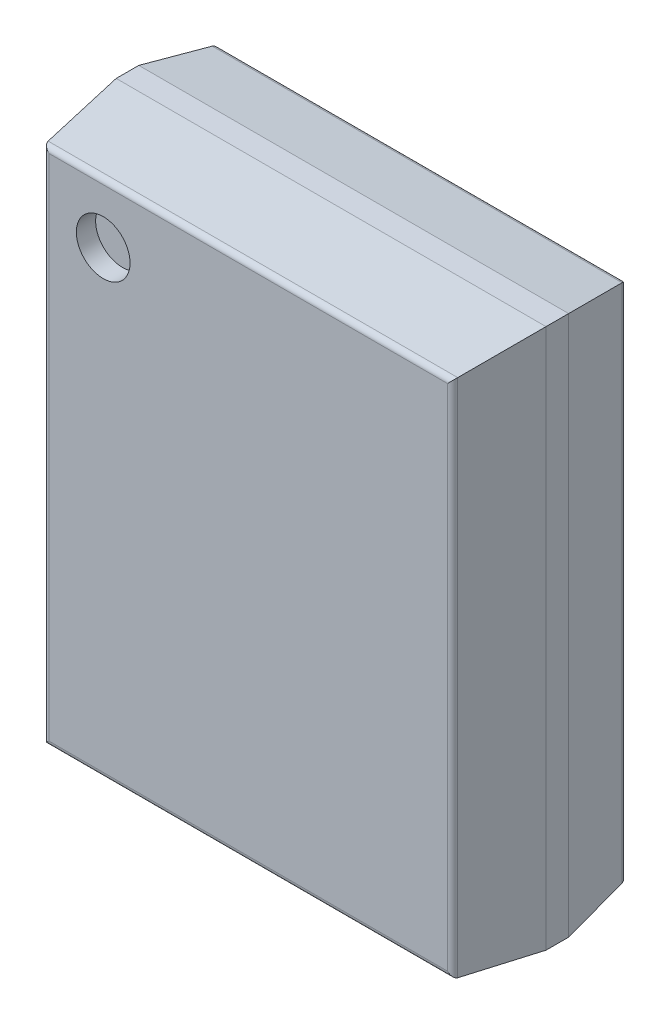
ISO-10303-21;
HEADER;
FILE_DESCRIPTION(('STEP AP214'),'2;1');
FILE_NAME('part.step','',(''),(''),'','','');
FILE_SCHEMA(('AUTOMOTIVE_DESIGN { 1 0 10303 214 1 1 1 1 }'));
ENDSEC;
DATA;
#1=APPLICATION_CONTEXT('core data for automotive mechanical design processes');
#2=APPLICATION_PROTOCOL_DEFINITION('international standard','automotive_design',2000,#1);
#3=PRODUCT_CONTEXT('',#1,'mechanical');
#4=PRODUCT('Part','Part','',(#3));
#5=PRODUCT_RELATED_PRODUCT_CATEGORY('part','',(#4));
#6=PRODUCT_DEFINITION_FORMATION('','',#4);
#7=PRODUCT_DEFINITION_CONTEXT('part definition',#1,'design');
#8=PRODUCT_DEFINITION('design','',#6,#7);
#9=PRODUCT_DEFINITION_SHAPE('','',#8);
#10=(LENGTH_UNIT() NAMED_UNIT(*) SI_UNIT(.MILLI.,.METRE.));
#11=(NAMED_UNIT(*) PLANE_ANGLE_UNIT() SI_UNIT($,.RADIAN.));
#12=(NAMED_UNIT(*) SI_UNIT($,.STERADIAN.) SOLID_ANGLE_UNIT());
#13=UNCERTAINTY_MEASURE_WITH_UNIT(LENGTH_MEASURE(1.E-05),#10,'distance_accuracy_value','');
#14=(GEOMETRIC_REPRESENTATION_CONTEXT(3) GLOBAL_UNCERTAINTY_ASSIGNED_CONTEXT((#13)) GLOBAL_UNIT_ASSIGNED_CONTEXT((#10,
#11,#12)) REPRESENTATION_CONTEXT('',''));
#15=CARTESIAN_POINT('',(0.,0.,0.));
#16=DIRECTION('',(0.,0.,1.));
#17=DIRECTION('',(1.,0.,0.));
#18=AXIS2_PLACEMENT_3D('',#15,#16,#17);
#19=CARTESIAN_POINT('',(-1.90125,-2.45,0.483623210137));
#20=DIRECTION('',(-0.987753092714965,0.,-0.156025087187994));
#21=DIRECTION('',(0.,1.,0.));
#22=AXIS2_PLACEMENT_3D('',#19,#20,#21);
#23=PLANE('',#22);
#24=DIRECTION('',(0.154159948465986,0.154159948465986,-0.975945398358909));
#25=VECTOR('',#24,1.);
#26=CARTESIAN_POINT('',(-1.902408557873,-2.402408557873,0.490957730138));
#27=LINE('',#26,#25);
#28=CARTESIAN_POINT('',(-1.95,-2.45,0.792246420274));
#29=VERTEX_POINT('',#28);
#30=CARTESIAN_POINT('',(-1.859165697143,-2.359165697143,0.217198745641));
#31=VERTEX_POINT('',#30);
#32=EDGE_CURVE('E11',#29,#31,#27,.T.);
#33=ORIENTED_EDGE('',*,*,#32,.F.);
#34=DIRECTION('',(0.,1.,0.));
#35=VECTOR('',#34,1.);
#36=CARTESIAN_POINT('',(-1.95,-2.45,0.792246420274));
#37=LINE('',#36,#35);
#38=CARTESIAN_POINT('',(-1.95,2.45,0.792246420274));
#39=VERTEX_POINT('',#38);
#40=EDGE_CURVE('E24',#29,#39,#37,.T.);
#41=ORIENTED_EDGE('',*,*,#40,.T.);
#42=DIRECTION('',(0.154159948465986,-0.154159948465986,-0.975945398358909));
#43=VECTOR('',#42,1.);
#44=CARTESIAN_POINT('',(-1.844183598082,2.344183598082,0.122351083963));
#45=LINE('',#44,#43);
#46=CARTESIAN_POINT('',(-1.859165697143,2.359165697143,0.217198745641));
#47=VERTEX_POINT('',#46);
#48=EDGE_CURVE('E221',#39,#47,#45,.T.);
#49=ORIENTED_EDGE('',*,*,#48,.T.);
#50=DIRECTION('',(0.,1.,0.));
#51=VECTOR('',#50,1.);
#52=CARTESIAN_POINT('',(-1.859165697143,-2.3525,0.217198745641));
#53=LINE('',#52,#51);
#54=EDGE_CURVE('E218',#31,#47,#53,.T.);
#55=ORIENTED_EDGE('',*,*,#54,.F.);
#56=EDGE_LOOP('',(#33,#41,#49,#55));
#57=FACE_BOUND('',#56,.T.);
#58=ADVANCED_FACE('F17',(#57),#23,.T.);
#59=CARTESIAN_POINT('',(-1.95,-2.40125,0.483623210137));
#60=DIRECTION('',(0.,-0.987753092714965,-0.156025087187994));
#61=DIRECTION('',(-1.,0.,0.));
#62=AXIS2_PLACEMENT_3D('',#59,#60,#61);
#63=PLANE('',#62);
#64=DIRECTION('',(1.,0.,0.));
#65=VECTOR('',#64,1.);
#66=CARTESIAN_POINT('',(-1.8525,-2.359165697143,0.217198745641));
#67=LINE('',#66,#65);
#68=CARTESIAN_POINT('',(1.859165697143,-2.359165697143,0.217198745641));
#69=VERTEX_POINT('',#68);
#70=EDGE_CURVE('E216',#31,#69,#67,.T.);
#71=ORIENTED_EDGE('',*,*,#70,.T.);
#72=DIRECTION('',(-0.154159948465986,0.154159948465986,-0.975945398358909));
#73=VECTOR('',#72,1.);
#74=CARTESIAN_POINT('',(1.856066242937,-2.356066242937,0.197576930121));
#75=LINE('',#74,#73);
#76=CARTESIAN_POINT('',(1.95,-2.45,0.792246420274));
#77=VERTEX_POINT('',#76);
#78=EDGE_CURVE('E214',#77,#69,#75,.T.);
#79=ORIENTED_EDGE('',*,*,#78,.F.);
#80=DIRECTION('',(1.,0.,0.));
#81=VECTOR('',#80,1.);
#82=CARTESIAN_POINT('',(-1.95,-2.45,0.792246420274));
#83=LINE('',#82,#81);
#84=EDGE_CURVE('E212',#29,#77,#83,.T.);
#85=ORIENTED_EDGE('',*,*,#84,.F.);
#86=ORIENTED_EDGE('',*,*,#32,.T.);
#87=EDGE_LOOP('',(#71,#79,#85,#86));
#88=FACE_BOUND('',#87,.T.);
#89=ADVANCED_FACE('F277',(#88),#63,.T.);
#90=CARTESIAN_POINT('',(-1.809778042507,-2.3525,0.225));
#91=DIRECTION('',(0.,1.,0.));
#92=DIRECTION('',(-0.987753092714965,0.,-0.156025087187994));
#93=AXIS2_PLACEMENT_3D('',#90,#91,#92);
#94=CYLINDRICAL_SURFACE('',#93,0.05);
#95=ORIENTED_EDGE('',*,*,#54,.T.);
#96=CARTESIAN_POINT('',(-1.809778042507,2.309778042507,0.225));
#97=DIRECTION('',(-0.707106781186548,-0.707106781186548,0.));
#98=DIRECTION('',(-0.707106781186548,0.707106781186548,0.));
#99=AXIS2_PLACEMENT_3D('',#96,#97,#98);
#100=ELLIPSE('',#99,0.07071067811865,0.05);
#101=CARTESIAN_POINT('',(-1.809778042507,2.309778042507,0.175));
#102=VERTEX_POINT('',#101);
#103=EDGE_CURVE('E210',#47,#102,#100,.T.);
#104=ORIENTED_EDGE('',*,*,#103,.T.);
#105=DIRECTION('',(0.,1.,0.));
#106=VECTOR('',#105,1.);
#107=CARTESIAN_POINT('',(-1.809778042507,-2.3525,0.175));
#108=LINE('',#107,#106);
#109=CARTESIAN_POINT('',(-1.809778042507,-2.309778042507,0.175));
#110=VERTEX_POINT('',#109);
#111=EDGE_CURVE('E207',#110,#102,#108,.T.);
#112=ORIENTED_EDGE('',*,*,#111,.F.);
#113=CARTESIAN_POINT('',(-1.809778042507,-2.309778042507,0.225));
#114=DIRECTION('',(0.707106781186548,-0.707106781186548,0.));
#115=DIRECTION('',(0.707106781186548,0.707106781186548,0.));
#116=AXIS2_PLACEMENT_3D('',#113,#114,#115);
#117=ELLIPSE('',#116,0.07071067811865,0.05);
#118=EDGE_CURVE('E204',#31,#110,#117,.T.);
#119=ORIENTED_EDGE('',*,*,#118,.F.);
#120=EDGE_LOOP('',(#95,#104,#112,#119));
#121=FACE_BOUND('',#120,.T.);
#122=ADVANCED_FACE('F253',(#121),#94,.T.);
#123=CARTESIAN_POINT('',(-1.95,-2.45,0.175));
#124=DIRECTION('',(1.,0.,0.));
#125=DIRECTION('',(0.,0.,1.));
#126=AXIS2_PLACEMENT_3D('',#123,#124,#125);
#127=PLANE('',#126);
#128=DIRECTION('',(0.,1.,0.));
#129=VECTOR('',#128,1.);
#130=CARTESIAN_POINT('',(-1.95,-2.45,0.997246420274));
#131=LINE('',#130,#129);
#132=CARTESIAN_POINT('',(-1.95,-2.45,0.997246420274));
#133=VERTEX_POINT('',#132);
#134=CARTESIAN_POINT('',(-1.95,2.45,0.997246420274));
#135=VERTEX_POINT('',#134);
#136=EDGE_CURVE('E201',#133,#135,#131,.T.);
#137=ORIENTED_EDGE('',*,*,#136,.T.);
#138=DIRECTION('',(0.,0.,1.));
#139=VECTOR('',#138,1.);
#140=CARTESIAN_POINT('',(-1.95,2.45,0.175));
#141=LINE('',#140,#139);
#142=EDGE_CURVE('E199',#39,#135,#141,.T.);
#143=ORIENTED_EDGE('',*,*,#142,.F.);
#144=ORIENTED_EDGE('',*,*,#40,.F.);
#145=DIRECTION('',(0.,0.,1.));
#146=VECTOR('',#145,1.);
#147=CARTESIAN_POINT('',(-1.95,-2.45,0.175));
#148=LINE('',#147,#146);
#149=EDGE_CURVE('E197',#29,#133,#148,.T.);
#150=ORIENTED_EDGE('',*,*,#149,.T.);
#151=EDGE_LOOP('',(#137,#143,#144,#150));
#152=FACE_BOUND('',#151,.T.);
#153=ADVANCED_FACE('F230',(#152),#127,.F.);
#154=CARTESIAN_POINT('',(-1.95,2.40125,0.483623210137));
#155=DIRECTION('',(0.,-0.987753092714965,0.156025087187994));
#156=DIRECTION('',(-1.,0.,0.));
#157=AXIS2_PLACEMENT_3D('',#154,#155,#156);
#158=PLANE('',#157);
#159=ORIENTED_EDGE('',*,*,#48,.F.);
#160=DIRECTION('',(1.,0.,0.));
#161=VECTOR('',#160,1.);
#162=CARTESIAN_POINT('',(-1.95,2.45,0.792246420274));
#163=LINE('',#162,#161);
#164=CARTESIAN_POINT('',(1.95,2.45,0.792246420274));
#165=VERTEX_POINT('',#164);
#166=EDGE_CURVE('E195',#39,#165,#163,.T.);
#167=ORIENTED_EDGE('',*,*,#166,.T.);
#168=DIRECTION('',(-0.154159948465986,-0.154159948465986,-0.975945398358909));
#169=VECTOR('',#168,1.);
#170=CARTESIAN_POINT('',(1.797841283145,2.297841283145,-0.171029716054));
#171=LINE('',#170,#169);
#172=CARTESIAN_POINT('',(1.859165697143,2.359165697143,0.217198745641));
#173=VERTEX_POINT('',#172);
#174=EDGE_CURVE('E193',#165,#173,#171,.T.);
#175=ORIENTED_EDGE('',*,*,#174,.T.);
#176=DIRECTION('',(1.,0.,0.));
#177=VECTOR('',#176,1.);
#178=CARTESIAN_POINT('',(-1.8525,2.359165697143,0.217198745641));
#179=LINE('',#178,#177);
#180=EDGE_CURVE('E190',#47,#173,#179,.T.);
#181=ORIENTED_EDGE('',*,*,#180,.F.);
#182=EDGE_LOOP('',(#159,#167,#175,#181));
#183=FACE_BOUND('',#182,.T.);
#184=ADVANCED_FACE('F227',(#183),#158,.F.);
#185=CARTESIAN_POINT('',(-1.8525,-2.309778042507,0.225));
#186=DIRECTION('',(1.,0.,0.));
#187=DIRECTION('',(0.,-0.987753092714965,-0.156025087187994));
#188=AXIS2_PLACEMENT_3D('',#185,#186,#187);
#189=CYLINDRICAL_SURFACE('',#188,0.05);
#190=ORIENTED_EDGE('',*,*,#118,.T.);
#191=DIRECTION('',(1.,0.,0.));
#192=VECTOR('',#191,1.);
#193=CARTESIAN_POINT('',(-1.8525,-2.309778042507,0.175));
#194=LINE('',#193,#192);
#195=CARTESIAN_POINT('',(1.809778042507,-2.309778042507,0.175));
#196=VERTEX_POINT('',#195);
#197=EDGE_CURVE('E188',#110,#196,#194,.T.);
#198=ORIENTED_EDGE('',*,*,#197,.T.);
#199=CARTESIAN_POINT('',(1.809778042507,-2.309778042507,0.225));
#200=DIRECTION('',(0.707106781186548,0.707106781186548,0.));
#201=DIRECTION('',(0.707106781186548,-0.707106781186548,0.));
#202=AXIS2_PLACEMENT_3D('',#199,#200,#201);
#203=ELLIPSE('',#202,0.07071067811865,0.05);
#204=EDGE_CURVE('E185',#69,#196,#203,.T.);
#205=ORIENTED_EDGE('',*,*,#204,.F.);
#206=ORIENTED_EDGE('',*,*,#70,.F.);
#207=EDGE_LOOP('',(#190,#198,#205,#206));
#208=FACE_BOUND('',#207,.T.);
#209=ADVANCED_FACE('F261',(#208),#189,.T.);
#210=CARTESIAN_POINT('',(-1.95,-2.45,0.175));
#211=DIRECTION('',(0.,1.,0.));
#212=DIRECTION('',(0.,0.,1.));
#213=AXIS2_PLACEMENT_3D('',#210,#211,#212);
#214=PLANE('',#213);
#215=DIRECTION('',(1.,0.,0.));
#216=VECTOR('',#215,1.);
#217=CARTESIAN_POINT('',(-1.95,-2.45,0.997246420274));
#218=LINE('',#217,#216);
#219=CARTESIAN_POINT('',(1.95,-2.45,0.997246420274));
#220=VERTEX_POINT('',#219);
#221=EDGE_CURVE('E182',#133,#220,#218,.T.);
#222=ORIENTED_EDGE('',*,*,#221,.F.);
#223=ORIENTED_EDGE('',*,*,#149,.F.);
#224=ORIENTED_EDGE('',*,*,#84,.T.);
#225=DIRECTION('',(0.,0.,1.));
#226=VECTOR('',#225,1.);
#227=CARTESIAN_POINT('',(1.95,-2.45,0.175));
#228=LINE('',#227,#226);
#229=EDGE_CURVE('E180',#77,#220,#228,.T.);
#230=ORIENTED_EDGE('',*,*,#229,.T.);
#231=EDGE_LOOP('',(#222,#223,#224,#230));
#232=FACE_BOUND('',#231,.T.);
#233=ADVANCED_FACE('F292',(#232),#214,.F.);
#234=CARTESIAN_POINT('',(1.90125,-2.45,0.483623210137));
#235=DIRECTION('',(-0.987753092714965,0.,0.156025087187994));
#236=DIRECTION('',(0.,1.,0.));
#237=AXIS2_PLACEMENT_3D('',#234,#235,#236);
#238=PLANE('',#237);
#239=DIRECTION('',(0.,1.,0.));
#240=VECTOR('',#239,1.);
#241=CARTESIAN_POINT('',(1.859165697143,-2.3525,0.217198745641));
#242=LINE('',#241,#240);
#243=EDGE_CURVE('E177',#69,#173,#242,.T.);
#244=ORIENTED_EDGE('',*,*,#243,.T.);
#245=ORIENTED_EDGE('',*,*,#174,.F.);
#246=DIRECTION('',(0.,1.,0.));
#247=VECTOR('',#246,1.);
#248=CARTESIAN_POINT('',(1.95,-2.45,0.792246420274));
#249=LINE('',#248,#247);
#250=EDGE_CURVE('E174',#77,#165,#249,.T.);
#251=ORIENTED_EDGE('',*,*,#250,.F.);
#252=ORIENTED_EDGE('',*,*,#78,.T.);
#253=EDGE_LOOP('',(#244,#245,#251,#252));
#254=FACE_BOUND('',#253,.T.);
#255=ADVANCED_FACE('F244',(#254),#238,.F.);
#256=CARTESIAN_POINT('',(-1.95,-2.45,0.175));
#257=DIRECTION('',(0.,0.,1.));
#258=DIRECTION('',(1.,0.,0.));
#259=AXIS2_PLACEMENT_3D('',#256,#257,#258);
#260=PLANE('',#259);
#261=DIRECTION('',(1.,0.,0.));
#262=VECTOR('',#261,1.);
#263=CARTESIAN_POINT('',(-1.8525,2.309778042507,0.175));
#264=LINE('',#263,#262);
#265=CARTESIAN_POINT('',(1.809778042507,2.309778042507,0.175));
#266=VERTEX_POINT('',#265);
#267=EDGE_CURVE('E171',#102,#266,#264,.T.);
#268=ORIENTED_EDGE('',*,*,#267,.T.);
#269=DIRECTION('',(0.,1.,0.));
#270=VECTOR('',#269,1.);
#271=CARTESIAN_POINT('',(1.809778042507,-2.3525,0.175));
#272=LINE('',#271,#270);
#273=EDGE_CURVE('E169',#196,#266,#272,.T.);
#274=ORIENTED_EDGE('',*,*,#273,.F.);
#275=ORIENTED_EDGE('',*,*,#197,.F.);
#276=ORIENTED_EDGE('',*,*,#111,.T.);
#277=EDGE_LOOP('',(#268,#274,#275,#276));
#278=FACE_BOUND('',#277,.T.);
#279=ADVANCED_FACE('F257',(#278),#260,.F.);
#280=CARTESIAN_POINT('',(-1.8525,2.309778042507,0.225));
#281=DIRECTION('',(1.,0.,0.));
#282=DIRECTION('',(0.,0.,-1.));
#283=AXIS2_PLACEMENT_3D('',#280,#281,#282);
#284=CYLINDRICAL_SURFACE('',#283,0.05);
#285=ORIENTED_EDGE('',*,*,#103,.F.);
#286=ORIENTED_EDGE('',*,*,#180,.T.);
#287=CARTESIAN_POINT('',(1.809778042507,2.309778042507,0.225));
#288=DIRECTION('',(0.707106781186548,-0.707106781186548,0.));
#289=DIRECTION('',(0.707106781186548,0.707106781186548,0.));
#290=AXIS2_PLACEMENT_3D('',#287,#288,#289);
#291=ELLIPSE('',#290,0.07071067811865,0.05);
#292=EDGE_CURVE('E166',#266,#173,#291,.T.);
#293=ORIENTED_EDGE('',*,*,#292,.F.);
#294=ORIENTED_EDGE('',*,*,#267,.F.);
#295=EDGE_LOOP('',(#285,#286,#293,#294));
#296=FACE_BOUND('',#295,.T.);
#297=ADVANCED_FACE('F250',(#296),#284,.T.);
#298=CARTESIAN_POINT('',(-1.90125,-2.45,1.373623210137));
#299=DIRECTION('',(0.991715798237691,0.,-0.12845145201896));
#300=DIRECTION('',(0.,1.,0.));
#301=AXIS2_PLACEMENT_3D('',#298,#299,#300);
#302=PLANE('',#301);
#303=DIRECTION('',(0.,1.,0.));
#304=VECTOR('',#303,1.);
#305=CARTESIAN_POINT('',(-1.858144342698,-2.3525,1.706422572601));
#306=LINE('',#305,#304);
#307=CARTESIAN_POINT('',(-1.858144342698,-2.358144342698,1.706422572601));
#308=VERTEX_POINT('',#307);
#309=CARTESIAN_POINT('',(-1.858144342698,2.358144342698,1.706422572601));
#310=VERTEX_POINT('',#309);
#311=EDGE_CURVE('E163',#308,#310,#306,.T.);
#312=ORIENTED_EDGE('',*,*,#311,.T.);
#313=DIRECTION('',(0.12740467794397,-0.12740467794397,0.983634127140771));
#314=VECTOR('',#313,1.);
#315=CARTESIAN_POINT('',(-1.862273025351,2.362273025351,1.674546873663));
#316=LINE('',#315,#314);
#317=EDGE_CURVE('E161',#135,#310,#316,.T.);
#318=ORIENTED_EDGE('',*,*,#317,.F.);
#319=ORIENTED_EDGE('',*,*,#136,.F.);
#320=DIRECTION('',(0.12740467794397,0.12740467794397,0.983634127140771));
#321=VECTOR('',#320,1.);
#322=CARTESIAN_POINT('',(-1.902041307658,-2.402041307658,1.367513880164));
#323=LINE('',#322,#321);
#324=EDGE_CURVE('E159',#133,#308,#323,.T.);
#325=ORIENTED_EDGE('',*,*,#324,.T.);
#326=EDGE_LOOP('',(#312,#318,#319,#325));
#327=FACE_BOUND('',#326,.T.);
#328=ADVANCED_FACE('F274',(#327),#302,.F.);
#329=CARTESIAN_POINT('',(-1.95,2.45,0.175));
#330=DIRECTION('',(0.,1.,0.));
#331=DIRECTION('',(0.,0.,1.));
#332=AXIS2_PLACEMENT_3D('',#329,#330,#331);
#333=PLANE('',#332);
#334=DIRECTION('',(0.,0.,1.));
#335=VECTOR('',#334,1.);
#336=CARTESIAN_POINT('',(1.95,2.45,0.175));
#337=LINE('',#336,#335);
#338=CARTESIAN_POINT('',(1.95,2.45,0.997246420274));
#339=VERTEX_POINT('',#338);
#340=EDGE_CURVE('E157',#165,#339,#337,.T.);
#341=ORIENTED_EDGE('',*,*,#340,.F.);
#342=ORIENTED_EDGE('',*,*,#166,.F.);
#343=ORIENTED_EDGE('',*,*,#142,.T.);
#344=DIRECTION('',(1.,0.,0.));
#345=VECTOR('',#344,1.);
#346=CARTESIAN_POINT('',(-1.95,2.45,0.997246420274));
#347=LINE('',#346,#345);
#348=EDGE_CURVE('E154',#135,#339,#347,.T.);
#349=ORIENTED_EDGE('',*,*,#348,.T.);
#350=EDGE_LOOP('',(#341,#342,#343,#349));
#351=FACE_BOUND('',#350,.T.);
#352=ADVANCED_FACE('F235',(#351),#333,.T.);
#353=CARTESIAN_POINT('',(1.809778042507,-2.3525,0.225));
#354=DIRECTION('',(0.,1.,0.));
#355=DIRECTION('',(0.,0.,-1.));
#356=AXIS2_PLACEMENT_3D('',#353,#354,#355);
#357=CYLINDRICAL_SURFACE('',#356,0.05);
#358=ORIENTED_EDGE('',*,*,#273,.T.);
#359=ORIENTED_EDGE('',*,*,#292,.T.);
#360=ORIENTED_EDGE('',*,*,#243,.F.);
#361=ORIENTED_EDGE('',*,*,#204,.T.);
#362=EDGE_LOOP('',(#358,#359,#360,#361));
#363=FACE_BOUND('',#362,.T.);
#364=ADVANCED_FACE('F264',(#363),#357,.T.);
#365=CARTESIAN_POINT('',(1.95,-2.45,0.175));
#366=DIRECTION('',(1.,0.,0.));
#367=DIRECTION('',(0.,0.,1.));
#368=AXIS2_PLACEMENT_3D('',#365,#366,#367);
#369=PLANE('',#368);
#370=ORIENTED_EDGE('',*,*,#229,.F.);
#371=ORIENTED_EDGE('',*,*,#250,.T.);
#372=ORIENTED_EDGE('',*,*,#340,.T.);
#373=DIRECTION('',(0.,1.,0.));
#374=VECTOR('',#373,1.);
#375=CARTESIAN_POINT('',(1.95,-2.45,0.997246420274));
#376=LINE('',#375,#374);
#377=EDGE_CURVE('E151',#220,#339,#376,.T.);
#378=ORIENTED_EDGE('',*,*,#377,.F.);
#379=EDGE_LOOP('',(#370,#371,#372,#378));
#380=FACE_BOUND('',#379,.T.);
#381=ADVANCED_FACE('F240',(#380),#369,.T.);
#382=CARTESIAN_POINT('',(-1.95,-2.40125,1.373623210137));
#383=DIRECTION('',(0.,0.991715798237691,-0.12845145201896));
#384=DIRECTION('',(-1.,0.,0.));
#385=AXIS2_PLACEMENT_3D('',#382,#383,#384);
#386=PLANE('',#385);
#387=ORIENTED_EDGE('',*,*,#324,.F.);
#388=ORIENTED_EDGE('',*,*,#221,.T.);
#389=DIRECTION('',(-0.12740467794397,0.12740467794397,0.983634127140771));
#390=VECTOR('',#389,1.);
#391=CARTESIAN_POINT('',(1.870389001332,-2.370389001332,1.611887079072));
#392=LINE('',#391,#390);
#393=CARTESIAN_POINT('',(1.858144342698,-2.358144342698,1.706422572601));
#394=VERTEX_POINT('',#393);
#395=EDGE_CURVE('E149',#220,#394,#392,.T.);
#396=ORIENTED_EDGE('',*,*,#395,.T.);
#397=DIRECTION('',(1.,0.,0.));
#398=VECTOR('',#397,1.);
#399=CARTESIAN_POINT('',(-1.8525,-2.358144342698,1.706422572601));
#400=LINE('',#399,#398);
#401=EDGE_CURVE('E146',#308,#394,#400,.T.);
#402=ORIENTED_EDGE('',*,*,#401,.F.);
#403=EDGE_LOOP('',(#387,#388,#396,#402));
#404=FACE_BOUND('',#403,.T.);
#405=ADVANCED_FACE('F272',(#404),#386,.F.);
#406=CARTESIAN_POINT('',(-1.808558552786,-2.3525,1.7));
#407=DIRECTION('',(0.,1.,0.));
#408=DIRECTION('',(-0.991715798237691,0.,0.12845145201896));
#409=AXIS2_PLACEMENT_3D('',#406,#407,#408);
#410=CYLINDRICAL_SURFACE('',#409,0.05);
#411=CARTESIAN_POINT('',(-1.808558552786,-2.308558552786,1.7));
#412=DIRECTION('',(-0.707106781186548,0.707106781186548,0.));
#413=DIRECTION('',(0.707106781186548,0.707106781186548,0.));
#414=AXIS2_PLACEMENT_3D('',#411,#412,#413);
#415=ELLIPSE('',#414,0.07071067811865,0.05);
#416=CARTESIAN_POINT('',(-1.808558552786,-2.308558552786,1.75));
#417=VERTEX_POINT('',#416);
#418=EDGE_CURVE('E144',#308,#417,#415,.T.);
#419=ORIENTED_EDGE('',*,*,#418,.T.);
#420=DIRECTION('',(0.,1.,0.));
#421=VECTOR('',#420,1.);
#422=CARTESIAN_POINT('',(-1.808558552786,-2.3525,1.75));
#423=LINE('',#422,#421);
#424=CARTESIAN_POINT('',(-1.808558552786,2.308558552786,1.75));
#425=VERTEX_POINT('',#424);
#426=EDGE_CURVE('E142',#417,#425,#423,.T.);
#427=ORIENTED_EDGE('',*,*,#426,.T.);
#428=CARTESIAN_POINT('',(-1.808558552786,2.308558552786,1.7));
#429=DIRECTION('',(0.707106781186548,0.707106781186548,0.));
#430=DIRECTION('',(-0.707106781186548,0.707106781186548,0.));
#431=AXIS2_PLACEMENT_3D('',#428,#429,#430);
#432=ELLIPSE('',#431,0.07071067811865,0.05);
#433=EDGE_CURVE('E139',#310,#425,#432,.T.);
#434=ORIENTED_EDGE('',*,*,#433,.F.);
#435=ORIENTED_EDGE('',*,*,#311,.F.);
#436=EDGE_LOOP('',(#419,#427,#434,#435));
#437=FACE_BOUND('',#436,.T.);
#438=ADVANCED_FACE('F312',(#437),#410,.T.);
#439=CARTESIAN_POINT('',(-1.95,2.40125,1.373623210137));
#440=DIRECTION('',(0.,0.991715798237691,0.12845145201896));
#441=DIRECTION('',(-1.,0.,0.));
#442=AXIS2_PLACEMENT_3D('',#439,#440,#441);
#443=PLANE('',#442);
#444=DIRECTION('',(1.,0.,0.));
#445=VECTOR('',#444,1.);
#446=CARTESIAN_POINT('',(-1.8525,2.358144342698,1.706422572601));
#447=LINE('',#446,#445);
#448=CARTESIAN_POINT('',(1.858144342698,2.358144342698,1.706422572601));
#449=VERTEX_POINT('',#448);
#450=EDGE_CURVE('E136',#310,#449,#447,.T.);
#451=ORIENTED_EDGE('',*,*,#450,.T.);
#452=DIRECTION('',(-0.12740467794397,-0.12740467794397,0.983634127140771));
#453=VECTOR('',#452,1.);
#454=CARTESIAN_POINT('',(1.830620719025,2.330620719025,1.91892007257));
#455=LINE('',#454,#453);
#456=EDGE_CURVE('E134',#339,#449,#455,.T.);
#457=ORIENTED_EDGE('',*,*,#456,.F.);
#458=ORIENTED_EDGE('',*,*,#348,.F.);
#459=ORIENTED_EDGE('',*,*,#317,.T.);
#460=EDGE_LOOP('',(#451,#457,#458,#459));
#461=FACE_BOUND('',#460,.T.);
#462=ADVANCED_FACE('F320',(#461),#443,.T.);
#463=CARTESIAN_POINT('',(1.90125,-2.45,1.373623210137));
#464=DIRECTION('',(0.991715798237691,0.,0.12845145201896));
#465=DIRECTION('',(0.,1.,0.));
#466=AXIS2_PLACEMENT_3D('',#463,#464,#465);
#467=PLANE('',#466);
#468=ORIENTED_EDGE('',*,*,#395,.F.);
#469=ORIENTED_EDGE('',*,*,#377,.T.);
#470=ORIENTED_EDGE('',*,*,#456,.T.);
#471=DIRECTION('',(0.,1.,0.));
#472=VECTOR('',#471,1.);
#473=CARTESIAN_POINT('',(1.858144342698,-2.3525,1.706422572601));
#474=LINE('',#473,#472);
#475=EDGE_CURVE('E131',#394,#449,#474,.T.);
#476=ORIENTED_EDGE('',*,*,#475,.F.);
#477=EDGE_LOOP('',(#468,#469,#470,#476));
#478=FACE_BOUND('',#477,.T.);
#479=ADVANCED_FACE('F327',(#478),#467,.T.);
#480=CARTESIAN_POINT('',(-1.8525,-2.308558552786,1.7));
#481=DIRECTION('',(1.,0.,0.));
#482=DIRECTION('',(0.,-0.991715798237691,0.12845145201896));
#483=AXIS2_PLACEMENT_3D('',#480,#481,#482);
#484=CYLINDRICAL_SURFACE('',#483,0.05);
#485=ORIENTED_EDGE('',*,*,#401,.T.);
#486=CARTESIAN_POINT('',(1.808558552786,-2.308558552786,1.7));
#487=DIRECTION('',(-0.707106781186548,-0.707106781186548,0.));
#488=DIRECTION('',(0.707106781186548,-0.707106781186548,0.));
#489=AXIS2_PLACEMENT_3D('',#486,#487,#488);
#490=ELLIPSE('',#489,0.07071067811865,0.05);
#491=CARTESIAN_POINT('',(1.808558552786,-2.308558552786,1.75));
#492=VERTEX_POINT('',#491);
#493=EDGE_CURVE('E129',#394,#492,#490,.T.);
#494=ORIENTED_EDGE('',*,*,#493,.T.);
#495=DIRECTION('',(1.,0.,0.));
#496=VECTOR('',#495,1.);
#497=CARTESIAN_POINT('',(-1.8525,-2.308558552786,1.75));
#498=LINE('',#497,#496);
#499=EDGE_CURVE('E126',#417,#492,#498,.T.);
#500=ORIENTED_EDGE('',*,*,#499,.F.);
#501=ORIENTED_EDGE('',*,*,#418,.F.);
#502=EDGE_LOOP('',(#485,#494,#500,#501));
#503=FACE_BOUND('',#502,.T.);
#504=ADVANCED_FACE('F332',(#503),#484,.T.);
#505=CARTESIAN_POINT('',(-1.95,-2.45,1.75));
#506=DIRECTION('',(0.,0.,1.));
#507=DIRECTION('',(1.,0.,0.));
#508=AXIS2_PLACEMENT_3D('',#505,#506,#507);
#509=PLANE('',#508);
#510=ORIENTED_EDGE('',*,*,#426,.F.);
#511=ORIENTED_EDGE('',*,*,#499,.T.);
#512=DIRECTION('',(0.,1.,0.));
#513=VECTOR('',#512,1.);
#514=CARTESIAN_POINT('',(1.808558552786,-2.3525,1.75));
#515=LINE('',#514,#513);
#516=CARTESIAN_POINT('',(1.808558552786,2.308558552786,1.75));
#517=VERTEX_POINT('',#516);
#518=EDGE_CURVE('E124',#492,#517,#515,.T.);
#519=ORIENTED_EDGE('',*,*,#518,.T.);
#520=DIRECTION('',(1.,0.,0.));
#521=VECTOR('',#520,1.);
#522=CARTESIAN_POINT('',(-1.8525,2.308558552786,1.75));
#523=LINE('',#522,#521);
#524=EDGE_CURVE('E121',#425,#517,#523,.T.);
#525=ORIENTED_EDGE('',*,*,#524,.F.);
#526=EDGE_LOOP('',(#510,#511,#519,#525));
#527=FACE_BOUND('',#526,.T.);
#528=CARTESIAN_POINT('',(-1.315,1.815,1.75));
#529=DIRECTION('',(0.,0.,1.));
#530=DIRECTION('',(1.,0.,0.));
#531=AXIS2_PLACEMENT_3D('',#528,#529,#530);
#532=CIRCLE('',#531,0.24375);
#533=CARTESIAN_POINT('',(-1.07125,1.815,1.75));
#534=VERTEX_POINT('',#533);
#535=EDGE_CURVE('E119',#534,#534,#532,.T.);
#536=ORIENTED_EDGE('',*,*,#535,.F.);
#537=EDGE_LOOP('',(#536));
#538=FACE_BOUND('',#537,.T.);
#539=ADVANCED_FACE('F335',(#527,#538),#509,.T.);
#540=CARTESIAN_POINT('',(-1.8525,2.308558552786,1.7));
#541=DIRECTION('',(1.,0.,0.));
#542=DIRECTION('',(0.,0.,1.));
#543=AXIS2_PLACEMENT_3D('',#540,#541,#542);
#544=CYLINDRICAL_SURFACE('',#543,0.05);
#545=ORIENTED_EDGE('',*,*,#524,.T.);
#546=CARTESIAN_POINT('',(1.808558552786,2.308558552786,1.7));
#547=DIRECTION('',(-0.707106781186548,0.707106781186548,0.));
#548=DIRECTION('',(0.707106781186548,0.707106781186548,0.));
#549=AXIS2_PLACEMENT_3D('',#546,#547,#548);
#550=ELLIPSE('',#549,0.07071067811865,0.05);
#551=EDGE_CURVE('E114',#517,#449,#550,.T.);
#552=ORIENTED_EDGE('',*,*,#551,.T.);
#553=ORIENTED_EDGE('',*,*,#450,.F.);
#554=ORIENTED_EDGE('',*,*,#433,.T.);
#555=EDGE_LOOP('',(#545,#552,#553,#554));
#556=FACE_BOUND('',#555,.T.);
#557=ADVANCED_FACE('F316',(#556),#544,.T.);
#558=CARTESIAN_POINT('',(1.808558552786,-2.3525,1.7));
#559=DIRECTION('',(0.,1.,0.));
#560=DIRECTION('',(0.,0.,1.));
#561=AXIS2_PLACEMENT_3D('',#558,#559,#560);
#562=CYLINDRICAL_SURFACE('',#561,0.05);
#563=ORIENTED_EDGE('',*,*,#493,.F.);
#564=ORIENTED_EDGE('',*,*,#475,.T.);
#565=ORIENTED_EDGE('',*,*,#551,.F.);
#566=ORIENTED_EDGE('',*,*,#518,.F.);
#567=EDGE_LOOP('',(#563,#564,#565,#566));
#568=FACE_BOUND('',#567,.T.);
#569=ADVANCED_FACE('F324',(#568),#562,.T.);
#570=CARTESIAN_POINT('',(-1.315,1.815,1.575));
#571=DIRECTION('',(0.,0.,1.));
#572=DIRECTION('',(1.,0.,0.));
#573=AXIS2_PLACEMENT_3D('',#570,#571,#572);
#574=CYLINDRICAL_SURFACE('',#573,0.24375);
#575=DIRECTION('',(0.,0.,1.));
#576=VECTOR('',#575,1.);
#577=CARTESIAN_POINT('',(-1.07125,1.815,1.575));
#578=LINE('',#577,#576);
#579=CARTESIAN_POINT('',(-1.07125,1.815,1.575));
#580=VERTEX_POINT('',#579);
#581=EDGE_CURVE('E112',#580,#534,#578,.T.);
#582=ORIENTED_EDGE('',*,*,#581,.T.);
#583=ORIENTED_EDGE('',*,*,#535,.T.);
#584=ORIENTED_EDGE('',*,*,#581,.F.);
#585=CARTESIAN_POINT('',(-1.315,1.815,1.575));
#586=DIRECTION('',(0.,0.,1.));
#587=DIRECTION('',(1.,0.,0.));
#588=AXIS2_PLACEMENT_3D('',#585,#586,#587);
#589=CIRCLE('',#588,0.24375);
#590=EDGE_CURVE('E107',#580,#580,#589,.T.);
#591=ORIENTED_EDGE('',*,*,#590,.F.);
#592=EDGE_LOOP('',(#582,#583,#584,#591));
#593=FACE_BOUND('',#592,.T.);
#594=ADVANCED_FACE('F340',(#593),#574,.F.);
#595=CARTESIAN_POINT('',(-1.315,1.815,1.575));
#596=DIRECTION('',(0.,0.,1.));
#597=DIRECTION('',(1.,0.,0.));
#598=AXIS2_PLACEMENT_3D('',#595,#596,#597);
#599=PLANE('',#598);
#600=ORIENTED_EDGE('',*,*,#590,.T.);
#601=EDGE_LOOP('',(#600));
#602=FACE_BOUND('',#601,.T.);
#603=ADVANCED_FACE('F108',(#602),#599,.T.);
#604=CLOSED_SHELL('',(#58,#89,#122,#153,#184,#209,#233,#255,#279,#297,#328,#352,#364,#381,#405,
#438,#462,#479,#504,#539,#557,#569,#594,#603));
#605=MANIFOLD_SOLID_BREP('B1',#604);
#606=ADVANCED_BREP_SHAPE_REPRESENTATION('',(#18,#605),#14);
#607=SHAPE_DEFINITION_REPRESENTATION(#9,#606);
ENDSEC;
END-ISO-10303-21;
